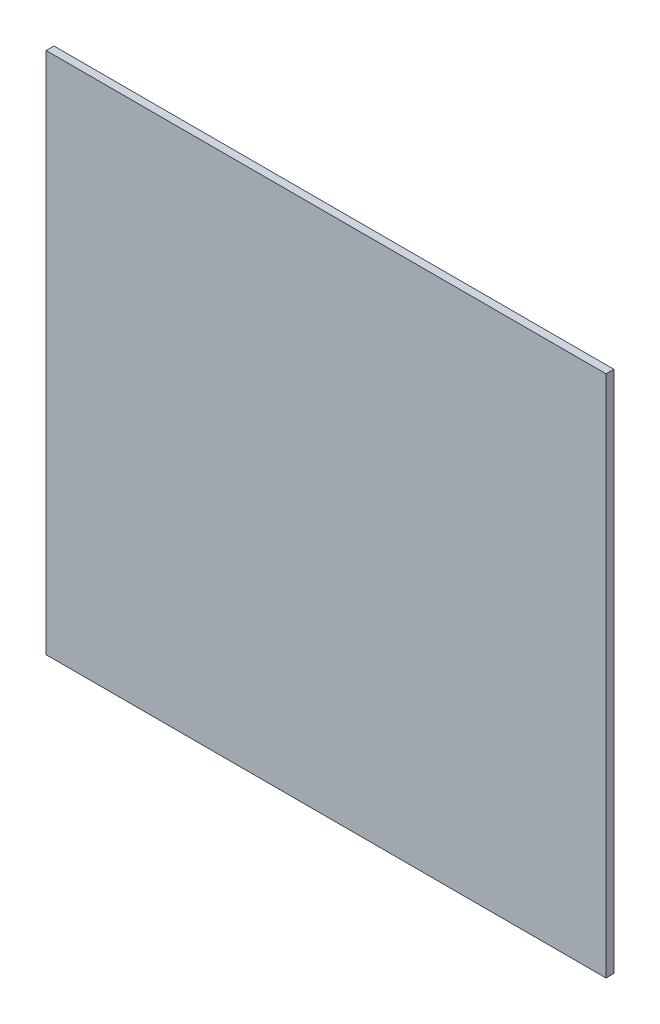
ISO-10303-21;
HEADER;
FILE_DESCRIPTION(('STEP AP214'),'2;1');
FILE_NAME('part.step','',(''),(''),'','','');
FILE_SCHEMA(('AUTOMOTIVE_DESIGN { 1 0 10303 214 1 1 1 1 }'));
ENDSEC;
DATA;
#1=APPLICATION_CONTEXT('core data for automotive mechanical design processes');
#2=APPLICATION_PROTOCOL_DEFINITION('international standard','automotive_design',2000,#1);
#3=PRODUCT_CONTEXT('',#1,'mechanical');
#4=PRODUCT('Part','Part','',(#3));
#5=PRODUCT_RELATED_PRODUCT_CATEGORY('part','',(#4));
#6=PRODUCT_DEFINITION_FORMATION('','',#4);
#7=PRODUCT_DEFINITION_CONTEXT('part definition',#1,'design');
#8=PRODUCT_DEFINITION('design','',#6,#7);
#9=PRODUCT_DEFINITION_SHAPE('','',#8);
#10=(LENGTH_UNIT() NAMED_UNIT(*) SI_UNIT(.MILLI.,.METRE.));
#11=(NAMED_UNIT(*) PLANE_ANGLE_UNIT() SI_UNIT($,.RADIAN.));
#12=(NAMED_UNIT(*) SI_UNIT($,.STERADIAN.) SOLID_ANGLE_UNIT());
#13=UNCERTAINTY_MEASURE_WITH_UNIT(LENGTH_MEASURE(1.E-05),#10,'distance_accuracy_value','');
#14=(GEOMETRIC_REPRESENTATION_CONTEXT(3) GLOBAL_UNCERTAINTY_ASSIGNED_CONTEXT((#13)) GLOBAL_UNIT_ASSIGNED_CONTEXT((#10,
#11,#12)) REPRESENTATION_CONTEXT('',''));
#15=CARTESIAN_POINT('',(0.,0.,0.));
#16=DIRECTION('',(0.,0.,1.));
#17=DIRECTION('',(1.,0.,0.));
#18=AXIS2_PLACEMENT_3D('',#15,#16,#17);
#19=CARTESIAN_POINT('',(107.,100.,3.));
#20=DIRECTION('',(-1.,0.,0.));
#21=DIRECTION('',(0.,-1.,0.));
#22=AXIS2_PLACEMENT_3D('',#19,#20,#21);
#23=PLANE('',#22);
#24=DIRECTION('',(0.,1.,0.));
#25=VECTOR('',#24,1.);
#26=CARTESIAN_POINT('',(107.,100.,0.));
#27=LINE('',#26,#25);
#28=CARTESIAN_POINT('',(107.,-100.,0.));
#29=VERTEX_POINT('',#28);
#30=CARTESIAN_POINT('',(107.,100.,0.));
#31=VERTEX_POINT('',#30);
#32=EDGE_CURVE('E103',#29,#31,#27,.T.);
#33=ORIENTED_EDGE('',*,*,#32,.T.);
#34=DIRECTION('',(0.,0.,-1.));
#35=VECTOR('',#34,1.);
#36=CARTESIAN_POINT('',(107.,100.,3.));
#37=LINE('',#36,#35);
#38=CARTESIAN_POINT('',(107.,100.,3.));
#39=VERTEX_POINT('',#38);
#40=EDGE_CURVE('E11',#39,#31,#37,.T.);
#41=ORIENTED_EDGE('',*,*,#40,.F.);
#42=DIRECTION('',(0.,1.,0.));
#43=VECTOR('',#42,1.);
#44=CARTESIAN_POINT('',(107.,100.,3.));
#45=LINE('',#44,#43);
#46=CARTESIAN_POINT('',(107.,-100.,3.));
#47=VERTEX_POINT('',#46);
#48=EDGE_CURVE('E89',#47,#39,#45,.T.);
#49=ORIENTED_EDGE('',*,*,#48,.F.);
#50=DIRECTION('',(0.,0.,-1.));
#51=VECTOR('',#50,1.);
#52=CARTESIAN_POINT('',(107.,-100.,3.));
#53=LINE('',#52,#51);
#54=EDGE_CURVE('E99',#47,#29,#53,.T.);
#55=ORIENTED_EDGE('',*,*,#54,.T.);
#56=EDGE_LOOP('',(#33,#41,#49,#55));
#57=FACE_BOUND('',#56,.T.);
#58=ADVANCED_FACE('F38',(#57),#23,.F.);
#59=CARTESIAN_POINT('',(-107.,100.,3.));
#60=DIRECTION('',(0.,-1.,0.));
#61=DIRECTION('',(0.,0.,-1.));
#62=AXIS2_PLACEMENT_3D('',#59,#60,#61);
#63=PLANE('',#62);
#64=DIRECTION('',(-1.,0.,0.));
#65=VECTOR('',#64,1.);
#66=CARTESIAN_POINT('',(-107.,100.,0.));
#67=LINE('',#66,#65);
#68=CARTESIAN_POINT('',(-107.,100.,0.));
#69=VERTEX_POINT('',#68);
#70=EDGE_CURVE('E93',#31,#69,#67,.T.);
#71=ORIENTED_EDGE('',*,*,#70,.T.);
#72=DIRECTION('',(0.,0.,-1.));
#73=VECTOR('',#72,1.);
#74=CARTESIAN_POINT('',(-107.,100.,3.));
#75=LINE('',#74,#73);
#76=CARTESIAN_POINT('',(-107.,100.,3.));
#77=VERTEX_POINT('',#76);
#78=EDGE_CURVE('E46',#77,#69,#75,.T.);
#79=ORIENTED_EDGE('',*,*,#78,.F.);
#80=DIRECTION('',(-1.,0.,0.));
#81=VECTOR('',#80,1.);
#82=CARTESIAN_POINT('',(-107.,100.,3.));
#83=LINE('',#82,#81);
#84=EDGE_CURVE('E84',#39,#77,#83,.T.);
#85=ORIENTED_EDGE('',*,*,#84,.F.);
#86=ORIENTED_EDGE('',*,*,#40,.T.);
#87=EDGE_LOOP('',(#71,#79,#85,#86));
#88=FACE_BOUND('',#87,.T.);
#89=ADVANCED_FACE('F92',(#88),#63,.F.);
#90=CARTESIAN_POINT('',(-107.,100.,3.));
#91=DIRECTION('',(1.,0.,0.));
#92=DIRECTION('',(0.,1.,0.));
#93=AXIS2_PLACEMENT_3D('',#90,#91,#92);
#94=PLANE('',#93);
#95=DIRECTION('',(0.,-1.,0.));
#96=VECTOR('',#95,1.);
#97=CARTESIAN_POINT('',(-107.,100.,0.));
#98=LINE('',#97,#96);
#99=CARTESIAN_POINT('',(-107.,-100.,0.));
#100=VERTEX_POINT('',#99);
#101=EDGE_CURVE('E71',#69,#100,#98,.T.);
#102=ORIENTED_EDGE('',*,*,#101,.T.);
#103=DIRECTION('',(0.,0.,-1.));
#104=VECTOR('',#103,1.);
#105=CARTESIAN_POINT('',(-107.,-100.,3.));
#106=LINE('',#105,#104);
#107=CARTESIAN_POINT('',(-107.,-100.,3.));
#108=VERTEX_POINT('',#107);
#109=EDGE_CURVE('E94',#108,#100,#106,.T.);
#110=ORIENTED_EDGE('',*,*,#109,.F.);
#111=DIRECTION('',(0.,-1.,0.));
#112=VECTOR('',#111,1.);
#113=CARTESIAN_POINT('',(-107.,100.,3.));
#114=LINE('',#113,#112);
#115=EDGE_CURVE('E87',#77,#108,#114,.T.);
#116=ORIENTED_EDGE('',*,*,#115,.F.);
#117=ORIENTED_EDGE('',*,*,#78,.T.);
#118=EDGE_LOOP('',(#102,#110,#116,#117));
#119=FACE_BOUND('',#118,.T.);
#120=ADVANCED_FACE('F95',(#119),#94,.F.);
#121=CARTESIAN_POINT('',(-107.,-100.,3.));
#122=DIRECTION('',(0.,1.,0.));
#123=DIRECTION('',(0.,0.,1.));
#124=AXIS2_PLACEMENT_3D('',#121,#122,#123);
#125=PLANE('',#124);
#126=DIRECTION('',(1.,0.,0.));
#127=VECTOR('',#126,1.);
#128=CARTESIAN_POINT('',(-107.,-100.,0.));
#129=LINE('',#128,#127);
#130=EDGE_CURVE('E77',#100,#29,#129,.T.);
#131=ORIENTED_EDGE('',*,*,#130,.T.);
#132=ORIENTED_EDGE('',*,*,#54,.F.);
#133=DIRECTION('',(1.,0.,0.));
#134=VECTOR('',#133,1.);
#135=CARTESIAN_POINT('',(-107.,-100.,3.));
#136=LINE('',#135,#134);
#137=EDGE_CURVE('E54',#108,#47,#136,.T.);
#138=ORIENTED_EDGE('',*,*,#137,.F.);
#139=ORIENTED_EDGE('',*,*,#109,.T.);
#140=EDGE_LOOP('',(#131,#132,#138,#139));
#141=FACE_BOUND('',#140,.T.);
#142=ADVANCED_FACE('F110',(#141),#125,.F.);
#143=CARTESIAN_POINT('',(0.,0.,3.));
#144=DIRECTION('',(0.,0.,1.));
#145=DIRECTION('',(1.,0.,0.));
#146=AXIS2_PLACEMENT_3D('',#143,#144,#145);
#147=PLANE('',#146);
#148=ORIENTED_EDGE('',*,*,#48,.T.);
#149=ORIENTED_EDGE('',*,*,#84,.T.);
#150=ORIENTED_EDGE('',*,*,#115,.T.);
#151=ORIENTED_EDGE('',*,*,#137,.T.);
#152=EDGE_LOOP('',(#148,#149,#150,#151));
#153=FACE_BOUND('',#152,.T.);
#154=ADVANCED_FACE('F85',(#153),#147,.T.);
#155=CARTESIAN_POINT('',(0.,0.,0.));
#156=DIRECTION('',(0.,0.,1.));
#157=DIRECTION('',(1.,0.,0.));
#158=AXIS2_PLACEMENT_3D('',#155,#156,#157);
#159=PLANE('',#158);
#160=ORIENTED_EDGE('',*,*,#32,.F.);
#161=ORIENTED_EDGE('',*,*,#130,.F.);
#162=ORIENTED_EDGE('',*,*,#101,.F.);
#163=ORIENTED_EDGE('',*,*,#70,.F.);
#164=EDGE_LOOP('',(#160,#161,#162,#163));
#165=FACE_BOUND('',#164,.T.);
#166=ADVANCED_FACE('F113',(#165),#159,.F.);
#167=CLOSED_SHELL('',(#58,#89,#120,#142,#154,#166));
#168=MANIFOLD_SOLID_BREP('B2',#167);
#169=ADVANCED_BREP_SHAPE_REPRESENTATION('',(#18,#168),#14);
#170=SHAPE_DEFINITION_REPRESENTATION(#9,#169);
ENDSEC;
END-ISO-10303-21;
